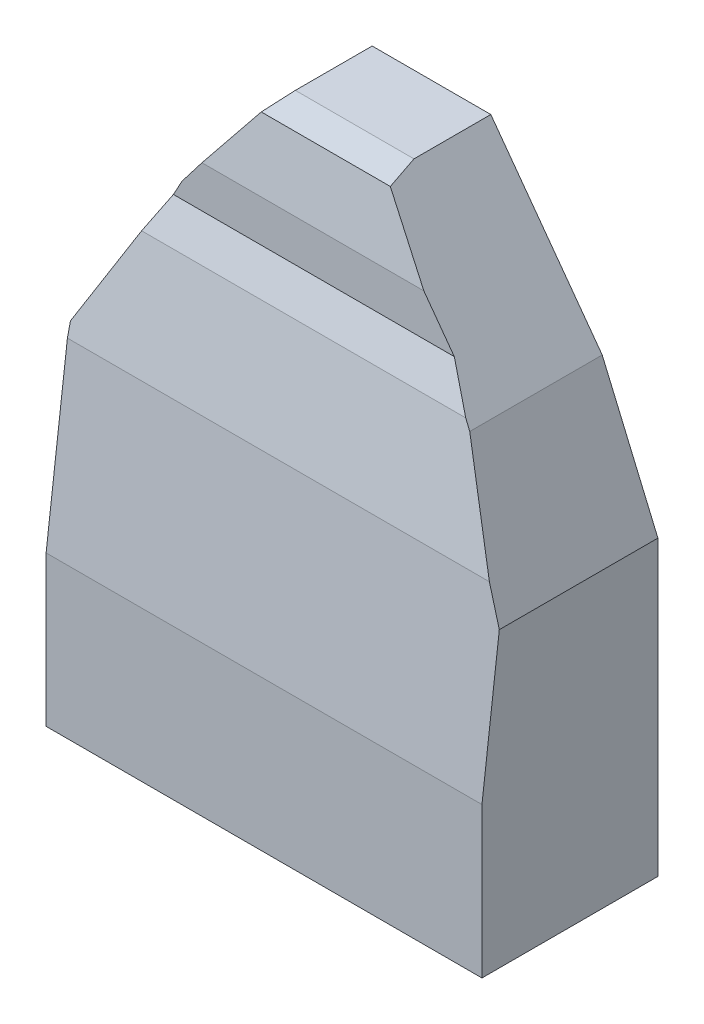
ISO-10303-21;
HEADER;
FILE_DESCRIPTION(('STEP AP214'),'2;1');
FILE_NAME('part.step','',(''),(''),'','','');
FILE_SCHEMA(('AUTOMOTIVE_DESIGN { 1 0 10303 214 1 1 1 1 }'));
ENDSEC;
DATA;
#1=APPLICATION_CONTEXT('core data for automotive mechanical design processes');
#2=APPLICATION_PROTOCOL_DEFINITION('international standard','automotive_design',2000,#1);
#3=PRODUCT_CONTEXT('',#1,'mechanical');
#4=PRODUCT('Part','Part','',(#3));
#5=PRODUCT_RELATED_PRODUCT_CATEGORY('part','',(#4));
#6=PRODUCT_DEFINITION_FORMATION('','',#4);
#7=PRODUCT_DEFINITION_CONTEXT('part definition',#1,'design');
#8=PRODUCT_DEFINITION('design','',#6,#7);
#9=PRODUCT_DEFINITION_SHAPE('','',#8);
#10=(LENGTH_UNIT() NAMED_UNIT(*) SI_UNIT(.MILLI.,.METRE.));
#11=(NAMED_UNIT(*) PLANE_ANGLE_UNIT() SI_UNIT($,.RADIAN.));
#12=(NAMED_UNIT(*) SI_UNIT($,.STERADIAN.) SOLID_ANGLE_UNIT());
#13=UNCERTAINTY_MEASURE_WITH_UNIT(LENGTH_MEASURE(1.E-05),#10,'distance_accuracy_value','');
#14=(GEOMETRIC_REPRESENTATION_CONTEXT(3) GLOBAL_UNCERTAINTY_ASSIGNED_CONTEXT((#13)) GLOBAL_UNIT_ASSIGNED_CONTEXT((#10,
#11,#12)) REPRESENTATION_CONTEXT('',''));
#15=CARTESIAN_POINT('',(0.,0.,0.));
#16=DIRECTION('',(0.,0.,1.));
#17=DIRECTION('',(1.,0.,0.));
#18=AXIS2_PLACEMENT_3D('',#15,#16,#17);
#19=CARTESIAN_POINT('',(576.302521008403,0.,101.6));
#20=DIRECTION('',(-1.,0.,0.));
#21=DIRECTION('',(0.,0.,1.));
#22=AXIS2_PLACEMENT_3D('',#19,#20,#21);
#23=PLANE('',#22);
#24=DIRECTION('',(0.,0.,-1.));
#25=VECTOR('',#24,1.);
#26=CARTESIAN_POINT('',(576.302521008403,387.403361344538,101.6));
#27=LINE('',#26,#25);
#28=CARTESIAN_POINT('',(576.302521008403,387.403361344538,209.68872265246));
#29=VERTEX_POINT('',#28);
#30=CARTESIAN_POINT('',(576.302521008403,387.403361344538,0.));
#31=VERTEX_POINT('',#30);
#32=EDGE_CURVE('E237',#29,#31,#27,.T.);
#33=ORIENTED_EDGE('',*,*,#32,.F.);
#34=DIRECTION('',(0.,-0.99270006358816,0.120609219183544));
#35=VECTOR('',#34,1.);
#36=CARTESIAN_POINT('',(576.302521008403,198.648214009807,232.621743180966));
#37=LINE('',#36,#35);
#38=CARTESIAN_POINT('',(576.302521008403,198.648214009807,232.621743180966));
#39=VERTEX_POINT('',#38);
#40=EDGE_CURVE('E200',#29,#39,#37,.T.);
#41=ORIENTED_EDGE('',*,*,#40,.T.);
#42=DIRECTION('',(0.,-1.,0.));
#43=VECTOR('',#42,1.);
#44=CARTESIAN_POINT('',(576.302521008403,0.,232.621743180966));
#45=LINE('',#44,#43);
#46=CARTESIAN_POINT('',(576.302521008403,0.,232.621743180966));
#47=VERTEX_POINT('',#46);
#48=EDGE_CURVE('E260',#39,#47,#45,.T.);
#49=ORIENTED_EDGE('',*,*,#48,.T.);
#50=DIRECTION('',(0.,0.,-1.));
#51=VECTOR('',#50,1.);
#52=CARTESIAN_POINT('',(576.302521008403,0.,101.6));
#53=LINE('',#52,#51);
#54=CARTESIAN_POINT('',(576.302521008403,0.,0.));
#55=VERTEX_POINT('',#54);
#56=EDGE_CURVE('E194',#47,#55,#53,.T.);
#57=ORIENTED_EDGE('',*,*,#56,.T.);
#58=DIRECTION('',(0.,1.,0.));
#59=VECTOR('',#58,1.);
#60=CARTESIAN_POINT('',(576.302521008403,0.,0.));
#61=LINE('',#60,#59);
#62=EDGE_CURVE('E195',#55,#31,#61,.T.);
#63=ORIENTED_EDGE('',*,*,#62,.T.);
#64=EDGE_LOOP('',(#33,#41,#49,#57,#63));
#65=FACE_BOUND('',#64,.T.);
#66=ADVANCED_FACE('F39',(#65),#23,.F.);
#67=CARTESIAN_POINT('',(576.302521008403,387.403361344538,101.6));
#68=DIRECTION('',(-0.920023978989581,-0.39186206512519,0.));
#69=DIRECTION('',(0.39186206512519,-0.920023978989581,0.));
#70=AXIS2_PLACEMENT_3D('',#67,#68,#69);
#71=PLANE('',#70);
#72=DIRECTION('',(-0.39186206512519,0.920023978989581,0.));
#73=VECTOR('',#72,1.);
#74=CARTESIAN_POINT('',(576.302521008403,387.403361344538,0.));
#75=LINE('',#74,#73);
#76=CARTESIAN_POINT('',(502.663865546219,560.294117647059,0.));
#77=VERTEX_POINT('',#76);
#78=EDGE_CURVE('E199',#31,#77,#75,.T.);
#79=ORIENTED_EDGE('',*,*,#78,.T.);
#80=DIRECTION('',(0.,0.,-1.));
#81=VECTOR('',#80,1.);
#82=CARTESIAN_POINT('',(502.663865546219,560.294117647059,101.6));
#83=LINE('',#82,#81);
#84=CARTESIAN_POINT('',(502.663865546219,560.294117647059,175.154658465266));
#85=VERTEX_POINT('',#84);
#86=EDGE_CURVE('E173',#85,#77,#83,.T.);
#87=ORIENTED_EDGE('',*,*,#86,.F.);
#88=DIRECTION('',(0.383675355992072,-0.900803009720522,0.203340008072209));
#89=VECTOR('',#88,1.);
#90=CARTESIAN_POINT('',(674.46393019594,156.937444121624,266.205141607066));
#91=LINE('',#90,#89);
#92=CARTESIAN_POINT('',(557.943732653935,430.506603568072,204.451845392607));
#93=VERTEX_POINT('',#92);
#94=EDGE_CURVE('E54',#85,#93,#91,.T.);
#95=ORIENTED_EDGE('',*,*,#94,.T.);
#96=DIRECTION('',(0.389436685103824,-0.914329608504635,0.111087511931388));
#97=VECTOR('',#96,1.);
#98=CARTESIAN_POINT('',(761.766874631309,-48.0346862918508,262.59276170168));
#99=LINE('',#98,#97);
#100=EDGE_CURVE('E47',#93,#29,#99,.T.);
#101=ORIENTED_EDGE('',*,*,#100,.T.);
#102=ORIENTED_EDGE('',*,*,#32,.T.);
#103=EDGE_LOOP('',(#79,#87,#95,#101,#102));
#104=FACE_BOUND('',#103,.T.);
#105=ADVANCED_FACE('F249',(#104),#71,.F.);
#106=CARTESIAN_POINT('',(502.663865546219,560.294117647059,101.6));
#107=DIRECTION('',(-0.807625937479147,-0.589695128953028,0.));
#108=DIRECTION('',(0.589695128953029,-0.807625937479147,0.));
#109=AXIS2_PLACEMENT_3D('',#106,#107,#108);
#110=PLANE('',#109);
#111=DIRECTION('',(-0.589695128953029,0.807625937479147,0.));
#112=VECTOR('',#111,1.);
#113=CARTESIAN_POINT('',(502.663865546219,560.294117647059,0.));
#114=LINE('',#113,#112);
#115=CARTESIAN_POINT('',(355.386554621849,762.,0.));
#116=VERTEX_POINT('',#115);
#117=EDGE_CURVE('E169',#77,#116,#114,.T.);
#118=ORIENTED_EDGE('',*,*,#117,.T.);
#119=DIRECTION('',(0.,0.,-1.));
#120=VECTOR('',#119,1.);
#121=CARTESIAN_POINT('',(355.386554621849,762.,101.6));
#122=LINE('',#121,#120);
#123=CARTESIAN_POINT('',(355.386554621849,762.,101.6));
#124=VERTEX_POINT('',#123);
#125=EDGE_CURVE('E165',#124,#116,#122,.T.);
#126=ORIENTED_EDGE('',*,*,#125,.F.);
#127=DIRECTION('',(0.169511170256458,-0.23215660274254,0.957793962687868));
#128=VECTOR('',#127,1.);
#129=CARTESIAN_POINT('',(390.484400505825,713.931211071947,299.914393323824));
#130=LINE('',#129,#128);
#131=CARTESIAN_POINT('',(362.113232086487,752.787376515822,139.607943988774));
#132=VERTEX_POINT('',#131);
#133=EDGE_CURVE('E151',#124,#132,#130,.T.);
#134=ORIENTED_EDGE('',*,*,#133,.T.);
#135=DIRECTION('',(0.582937835084133,-0.798371382832616,0.150952361695207));
#136=VECTOR('',#135,1.);
#137=CARTESIAN_POINT('',(737.107267816838,239.208588450341,236.713041493628));
#138=LINE('',#137,#136);
#139=CARTESIAN_POINT('',(421.897970408379,670.908278379318,155.089264465625));
#140=VERTEX_POINT('',#139);
#141=EDGE_CURVE('E162',#132,#140,#138,.T.);
#142=ORIENTED_EDGE('',*,*,#141,.T.);
#143=DIRECTION('',(0.589695128953028,-0.807625937479147,0.));
#144=VECTOR('',#143,1.);
#145=CARTESIAN_POINT('',(770.748157817613,193.135195623194,155.089264465625));
#146=LINE('',#145,#144);
#147=CARTESIAN_POINT('',(462.205314743502,615.704741572519,155.089264465625));
#148=VERTEX_POINT('',#147);
#149=EDGE_CURVE('E395',#140,#148,#146,.T.);
#150=ORIENTED_EDGE('',*,*,#149,.T.);
#151=DIRECTION('',(0.561922004369035,-0.769588832070635,0.303276590850731));
#152=VECTOR('',#151,1.);
#153=CARTESIAN_POINT('',(764.798154631275,201.284113030569,318.402543147512));
#154=LINE('',#153,#152);
#155=CARTESIAN_POINT('',(494.984202869431,570.811916530486,172.780455352289));
#156=VERTEX_POINT('',#155);
#157=EDGE_CURVE('E398',#148,#156,#154,.T.);
#158=ORIENTED_EDGE('',*,*,#157,.T.);
#159=DIRECTION('',(0.580133321909504,-0.794530419136929,0.179350890369519));
#160=VECTOR('',#159,1.);
#161=CARTESIAN_POINT('',(850.537095698349,83.8590415691422,282.701270954521));
#162=LINE('',#161,#160);
#163=EDGE_CURVE('E11',#156,#85,#162,.T.);
#164=ORIENTED_EDGE('',*,*,#163,.T.);
#165=ORIENTED_EDGE('',*,*,#86,.T.);
#166=EDGE_LOOP('',(#118,#126,#134,#142,#150,#158,#164,#165));
#167=FACE_BOUND('',#166,.T.);
#168=ADVANCED_FACE('F166',(#167),#110,.F.);
#169=CARTESIAN_POINT('',(355.386554621849,762.,101.6));
#170=DIRECTION('',(0.,-1.,0.));
#171=DIRECTION('',(0.,0.,-1.));
#172=AXIS2_PLACEMENT_3D('',#169,#170,#171);
#173=PLANE('',#172);
#174=DIRECTION('',(-1.,0.,0.));
#175=VECTOR('',#174,1.);
#176=CARTESIAN_POINT('',(355.386554621849,762.,0.));
#177=LINE('',#176,#175);
#178=CARTESIAN_POINT('',(198.504201680673,762.,0.));
#179=VERTEX_POINT('',#178);
#180=EDGE_CURVE('E205',#116,#179,#177,.T.);
#181=ORIENTED_EDGE('',*,*,#180,.T.);
#182=DIRECTION('',(0.,0.,-1.));
#183=VECTOR('',#182,1.);
#184=CARTESIAN_POINT('',(198.504201680673,762.,101.6));
#185=LINE('',#184,#183);
#186=CARTESIAN_POINT('',(198.504201680672,762.,101.6));
#187=VERTEX_POINT('',#186);
#188=EDGE_CURVE('E174',#187,#179,#185,.T.);
#189=ORIENTED_EDGE('',*,*,#188,.F.);
#190=DIRECTION('',(-1.,0.,0.));
#191=VECTOR('',#190,1.);
#192=CARTESIAN_POINT('',(355.386554621849,762.,101.6));
#193=LINE('',#192,#191);
#194=CARTESIAN_POINT('',(198.514140193442,762.,101.6));
#195=VERTEX_POINT('',#194);
#196=EDGE_CURVE('E179',#195,#187,#193,.T.);
#197=ORIENTED_EDGE('',*,*,#196,.F.);
#198=EDGE_CURVE('E156',#124,#195,#193,.T.);
#199=ORIENTED_EDGE('',*,*,#198,.F.);
#200=ORIENTED_EDGE('',*,*,#125,.T.);
#201=EDGE_LOOP('',(#181,#189,#197,#199,#200));
#202=FACE_BOUND('',#201,.T.);
#203=ADVANCED_FACE('F177',(#202),#173,.F.);
#204=CARTESIAN_POINT('',(198.504201680673,762.,101.6));
#205=DIRECTION('',(0.7926239891046,-0.609710760849693,0.));
#206=DIRECTION('',(0.609710760849693,0.7926239891046,0.));
#207=AXIS2_PLACEMENT_3D('',#204,#205,#206);
#208=PLANE('',#207);
#209=DIRECTION('',(-0.609710760849693,-0.7926239891046,0.));
#210=VECTOR('',#209,1.);
#211=CARTESIAN_POINT('',(198.504201680673,762.,0.));
#212=LINE('',#211,#210);
#213=CARTESIAN_POINT('',(102.453781512605,637.134453781513,0.));
#214=VERTEX_POINT('',#213);
#215=EDGE_CURVE('E208',#179,#214,#212,.T.);
#216=ORIENTED_EDGE('',*,*,#215,.T.);
#217=DIRECTION('',(0.,0.,-1.));
#218=VECTOR('',#217,1.);
#219=CARTESIAN_POINT('',(102.453781512605,637.134453781513,101.6));
#220=LINE('',#219,#218);
#221=CARTESIAN_POINT('',(102.453781512605,637.134453781513,101.6));
#222=VERTEX_POINT('',#221);
#223=EDGE_CURVE('E228',#222,#214,#220,.T.);
#224=ORIENTED_EDGE('',*,*,#223,.F.);
#225=DIRECTION('',(-0.609710760849693,-0.7926239891046,0.));
#226=VECTOR('',#225,1.);
#227=CARTESIAN_POINT('',(198.504201680673,762.,101.6));
#228=LINE('',#227,#226);
#229=EDGE_CURVE('E181',#187,#222,#228,.T.);
#230=ORIENTED_EDGE('',*,*,#229,.F.);
#231=ORIENTED_EDGE('',*,*,#188,.T.);
#232=EDGE_LOOP('',(#216,#224,#230,#231));
#233=FACE_BOUND('',#232,.T.);
#234=ADVANCED_FACE('F321',(#233),#208,.F.);
#235=CARTESIAN_POINT('',(102.453781512605,637.134453781513,101.6));
#236=DIRECTION('',(0.879031855696728,-0.476763040377887,0.));
#237=DIRECTION('',(0.476763040377887,0.879031855696728,0.));
#238=AXIS2_PLACEMENT_3D('',#235,#236,#237);
#239=PLANE('',#238);
#240=DIRECTION('',(-0.476763040377887,-0.879031855696728,0.));
#241=VECTOR('',#240,1.);
#242=CARTESIAN_POINT('',(102.453781512605,637.134453781513,0.));
#243=LINE('',#242,#241);
#244=CARTESIAN_POINT('',(0.,448.235294117647,0.));
#245=VERTEX_POINT('',#244);
#246=EDGE_CURVE('E211',#214,#245,#243,.T.);
#247=ORIENTED_EDGE('',*,*,#246,.T.);
#248=DIRECTION('',(0.,0.,-1.));
#249=VECTOR('',#248,1.);
#250=CARTESIAN_POINT('',(0.,448.235294117647,101.6));
#251=LINE('',#250,#249);
#252=CARTESIAN_POINT('',(-1.38777878078145E-13,448.235294117647,200.449913737673));
#253=VERTEX_POINT('',#252);
#254=EDGE_CURVE('E62',#253,#245,#251,.T.);
#255=ORIENTED_EDGE('',*,*,#254,.F.);
#256=DIRECTION('',(0.467645680255062,0.862221722970269,-0.194630979489293));
#257=VECTOR('',#256,1.);
#258=CARTESIAN_POINT('',(287.609450899066,978.5152192128,80.7487991922936));
#259=LINE('',#258,#257);
#260=CARTESIAN_POINT('',(66.4822358849297,570.811916530486,172.780455352289));
#261=VERTEX_POINT('',#260);
#262=EDGE_CURVE('E241',#253,#261,#259,.T.);
#263=ORIENTED_EDGE('',*,*,#262,.T.);
#264=DIRECTION('',(0.450499381355594,0.830608234374376,-0.327322880941294));
#265=VECTOR('',#264,1.);
#266=CARTESIAN_POINT('',(326.867193589269,1050.89668229786,-16.4094925963554));
#267=LINE('',#266,#265);
#268=CARTESIAN_POINT('',(90.8308867551849,615.704741572519,155.089264465625));
#269=VERTEX_POINT('',#268);
#270=EDGE_CURVE('E381',#261,#269,#267,.T.);
#271=ORIENTED_EDGE('',*,*,#270,.T.);
#272=DIRECTION('',(0.476763040377887,0.879031855696728,0.));
#273=VECTOR('',#272,1.);
#274=CARTESIAN_POINT('',(376.926672521761,1143.19384657964,155.089264465625));
#275=LINE('',#274,#273);
#276=CARTESIAN_POINT('',(102.079559314268,636.444481603329,155.089264465625));
#277=VERTEX_POINT('',#276);
#278=EDGE_CURVE('E379',#269,#277,#275,.T.);
#279=ORIENTED_EDGE('',*,*,#278,.T.);
#280=DIRECTION('',(0.,0.,-1.));
#281=VECTOR('',#280,1.);
#282=CARTESIAN_POINT('',(102.079559314268,636.444481603329,232.621743180966));
#283=LINE('',#282,#281);
#284=CARTESIAN_POINT('',(102.079559314268,636.444481603329,101.6));
#285=VERTEX_POINT('',#284);
#286=EDGE_CURVE('E372',#277,#285,#283,.T.);
#287=ORIENTED_EDGE('',*,*,#286,.T.);
#288=DIRECTION('',(-0.476763040377887,-0.879031855696728,0.));
#289=VECTOR('',#288,1.);
#290=CARTESIAN_POINT('',(102.453781512605,637.134453781513,101.6));
#291=LINE('',#290,#289);
#292=EDGE_CURVE('E185',#222,#285,#291,.T.);
#293=ORIENTED_EDGE('',*,*,#292,.F.);
#294=ORIENTED_EDGE('',*,*,#223,.T.);
#295=EDGE_LOOP('',(#247,#255,#263,#271,#279,#287,#293,#294));
#296=FACE_BOUND('',#295,.T.);
#297=ADVANCED_FACE('F324',(#296),#239,.F.);
#298=CARTESIAN_POINT('',(0.,448.235294117647,101.6));
#299=DIRECTION('',(1.,0.,0.));
#300=DIRECTION('',(0.,0.,-1.));
#301=AXIS2_PLACEMENT_3D('',#298,#299,#300);
#302=PLANE('',#301);
#303=DIRECTION('',(0.,0.975456616301023,-0.220191711275785));
#304=VECTOR('',#303,1.);
#305=CARTESIAN_POINT('',(0.,430.506603568072,204.451845392607));
#306=LINE('',#305,#304);
#307=CARTESIAN_POINT('',(0.,430.506603568072,204.451845392607));
#308=VERTEX_POINT('',#307);
#309=EDGE_CURVE('E275',#308,#253,#306,.T.);
#310=ORIENTED_EDGE('',*,*,#309,.T.);
#311=ORIENTED_EDGE('',*,*,#254,.T.);
#312=DIRECTION('',(0.,-1.,0.));
#313=VECTOR('',#312,1.);
#314=CARTESIAN_POINT('',(0.,448.235294117647,0.));
#315=LINE('',#314,#313);
#316=CARTESIAN_POINT('',(0.,0.,0.));
#317=VERTEX_POINT('',#316);
#318=EDGE_CURVE('E214',#245,#317,#315,.T.);
#319=ORIENTED_EDGE('',*,*,#318,.T.);
#320=DIRECTION('',(0.,0.,-1.));
#321=VECTOR('',#320,1.);
#322=CARTESIAN_POINT('',(0.,0.,101.6));
#323=LINE('',#322,#321);
#324=CARTESIAN_POINT('',(0.,0.,232.621743180966));
#325=VERTEX_POINT('',#324);
#326=EDGE_CURVE('E222',#325,#317,#323,.T.);
#327=ORIENTED_EDGE('',*,*,#326,.F.);
#328=DIRECTION('',(0.,1.,0.));
#329=VECTOR('',#328,1.);
#330=CARTESIAN_POINT('',(0.,0.,232.621743180966));
#331=LINE('',#330,#329);
#332=CARTESIAN_POINT('',(0.,198.648214009807,232.621743180966));
#333=VERTEX_POINT('',#332);
#334=EDGE_CURVE('E266',#325,#333,#331,.T.);
#335=ORIENTED_EDGE('',*,*,#334,.T.);
#336=DIRECTION('',(0.,0.992700063588159,-0.120609219183544));
#337=VECTOR('',#336,1.);
#338=CARTESIAN_POINT('',(0.,198.648214009807,232.621743180966));
#339=LINE('',#338,#337);
#340=EDGE_CURVE('E270',#333,#308,#339,.T.);
#341=ORIENTED_EDGE('',*,*,#340,.T.);
#342=EDGE_LOOP('',(#310,#311,#319,#327,#335,#341));
#343=FACE_BOUND('',#342,.T.);
#344=ADVANCED_FACE('F303',(#343),#302,.F.);
#345=CARTESIAN_POINT('',(0.,0.,101.6));
#346=DIRECTION('',(0.,1.,0.));
#347=DIRECTION('',(0.,0.,1.));
#348=AXIS2_PLACEMENT_3D('',#345,#346,#347);
#349=PLANE('',#348);
#350=DIRECTION('',(1.,0.,0.));
#351=VECTOR('',#350,1.);
#352=CARTESIAN_POINT('',(0.,0.,0.));
#353=LINE('',#352,#351);
#354=EDGE_CURVE('E187',#317,#55,#353,.T.);
#355=ORIENTED_EDGE('',*,*,#354,.T.);
#356=ORIENTED_EDGE('',*,*,#56,.F.);
#357=DIRECTION('',(-1.,0.,0.));
#358=VECTOR('',#357,1.);
#359=CARTESIAN_POINT('',(1349.48470987865,0.,232.621743180966));
#360=LINE('',#359,#358);
#361=EDGE_CURVE('E189',#47,#325,#360,.T.);
#362=ORIENTED_EDGE('',*,*,#361,.T.);
#363=ORIENTED_EDGE('',*,*,#326,.T.);
#364=EDGE_LOOP('',(#355,#356,#362,#363));
#365=FACE_BOUND('',#364,.T.);
#366=ADVANCED_FACE('F299',(#365),#349,.F.);
#367=CARTESIAN_POINT('',(0.,0.,0.));
#368=DIRECTION('',(0.,0.,1.));
#369=DIRECTION('',(1.,0.,0.));
#370=AXIS2_PLACEMENT_3D('',#367,#368,#369);
#371=PLANE('',#370);
#372=ORIENTED_EDGE('',*,*,#62,.F.);
#373=ORIENTED_EDGE('',*,*,#354,.F.);
#374=ORIENTED_EDGE('',*,*,#318,.F.);
#375=ORIENTED_EDGE('',*,*,#246,.F.);
#376=ORIENTED_EDGE('',*,*,#215,.F.);
#377=ORIENTED_EDGE('',*,*,#180,.F.);
#378=ORIENTED_EDGE('',*,*,#117,.F.);
#379=ORIENTED_EDGE('',*,*,#78,.F.);
#380=EDGE_LOOP('',(#372,#373,#374,#375,#376,#377,#378,#379));
#381=FACE_BOUND('',#380,.T.);
#382=ADVANCED_FACE('F308',(#381),#371,.F.);
#383=CARTESIAN_POINT('',(1349.48470987865,752.787376515822,139.607943988774));
#384=DIRECTION('',(0.,0.971858439473431,0.235565646103729));
#385=DIRECTION('',(0.,-0.235565646103729,0.971858439473431));
#386=AXIS2_PLACEMENT_3D('',#383,#384,#385);
#387=PLANE('',#386);
#388=ORIENTED_EDGE('',*,*,#133,.F.);
#389=ORIENTED_EDGE('',*,*,#198,.T.);
#390=DIRECTION('',(0.178038698581419,0.231802128357528,-0.956331529908094));
#391=VECTOR('',#390,1.);
#392=CARTESIAN_POINT('',(228.145761982899,800.579663029498,-57.5657006333951));
#393=LINE('',#392,#391);
#394=CARTESIAN_POINT('',(191.438262559075,752.787376515822,139.607943988774));
#395=VERTEX_POINT('',#394);
#396=EDGE_CURVE('E271',#395,#195,#393,.T.);
#397=ORIENTED_EDGE('',*,*,#396,.F.);
#398=DIRECTION('',(-1.,0.,0.));
#399=VECTOR('',#398,1.);
#400=CARTESIAN_POINT('',(1349.48470987865,752.787376515822,139.607943988774));
#401=LINE('',#400,#399);
#402=EDGE_CURVE('E157',#132,#395,#401,.T.);
#403=ORIENTED_EDGE('',*,*,#402,.F.);
#404=EDGE_LOOP('',(#388,#389,#397,#403));
#405=FACE_BOUND('',#404,.T.);
#406=ADVANCED_FACE('F153',(#405),#387,.T.);
#407=CARTESIAN_POINT('',(1349.48470987865,670.908278379318,155.089264465625));
#408=DIRECTION('',(0.,0.185783690480533,0.982590667751039));
#409=DIRECTION('',(0.,-0.982590667751039,0.185783690480533));
#410=AXIS2_PLACEMENT_3D('',#407,#408,#409);
#411=PLANE('',#410);
#412=ORIENTED_EDGE('',*,*,#141,.F.);
#413=ORIENTED_EDGE('',*,*,#402,.T.);
#414=DIRECTION('',(0.602394096410472,0.784302709301712,-0.148292322093244));
#415=VECTOR('',#414,1.);
#416=CARTESIAN_POINT('',(571.601094944895,1247.75029396919,46.0226490398937));
#417=LINE('',#416,#415);
#418=CARTESIAN_POINT('',(128.549935447776,670.908278379318,155.089264465625));
#419=VERTEX_POINT('',#418);
#420=EDGE_CURVE('E388',#419,#395,#417,.T.);
#421=ORIENTED_EDGE('',*,*,#420,.F.);
#422=DIRECTION('',(-1.,0.,0.));
#423=VECTOR('',#422,1.);
#424=CARTESIAN_POINT('',(1349.48470987865,670.908278379318,155.089264465625));
#425=LINE('',#424,#423);
#426=EDGE_CURVE('E281',#140,#419,#425,.T.);
#427=ORIENTED_EDGE('',*,*,#426,.F.);
#428=EDGE_LOOP('',(#412,#413,#421,#427));
#429=FACE_BOUND('',#428,.T.);
#430=ADVANCED_FACE('F350',(#429),#411,.T.);
#431=CARTESIAN_POINT('',(1349.48470987865,615.704741572519,155.089264465625));
#432=DIRECTION('',(0.,0.,1.));
#433=DIRECTION('',(1.,0.,0.));
#434=AXIS2_PLACEMENT_3D('',#431,#432,#433);
#435=PLANE('',#434);
#436=ORIENTED_EDGE('',*,*,#149,.F.);
#437=ORIENTED_EDGE('',*,*,#426,.T.);
#438=DIRECTION('',(0.609128886515623,0.793071244978809,0.));
#439=VECTOR('',#438,1.);
#440=CARTESIAN_POINT('',(554.895264424791,1225.99970209565,155.089264465625));
#441=LINE('',#440,#439);
#442=EDGE_CURVE('E244',#277,#419,#441,.T.);
#443=ORIENTED_EDGE('',*,*,#442,.F.);
#444=ORIENTED_EDGE('',*,*,#278,.F.);
#445=DIRECTION('',(-1.,0.,0.));
#446=VECTOR('',#445,1.);
#447=CARTESIAN_POINT('',(1349.48470987865,615.704741572519,155.089264465625));
#448=LINE('',#447,#446);
#449=EDGE_CURVE('E284',#148,#269,#448,.T.);
#450=ORIENTED_EDGE('',*,*,#449,.F.);
#451=EDGE_LOOP('',(#436,#437,#443,#444,#450));
#452=FACE_BOUND('',#451,.T.);
#453=ADVANCED_FACE('F346',(#452),#435,.T.);
#454=CARTESIAN_POINT('',(1349.48470987865,570.811916530486,172.780455352289));
#455=DIRECTION('',(0.,0.366634642563736,0.930365003034917));
#456=DIRECTION('',(0.,-0.930365003034917,0.366634642563736));
#457=AXIS2_PLACEMENT_3D('',#454,#455,#456);
#458=PLANE('',#457);
#459=ORIENTED_EDGE('',*,*,#157,.F.);
#460=ORIENTED_EDGE('',*,*,#449,.T.);
#461=ORIENTED_EDGE('',*,*,#270,.F.);
#462=DIRECTION('',(-1.,0.,0.));
#463=VECTOR('',#462,1.);
#464=CARTESIAN_POINT('',(1349.48470987865,570.811916530486,172.780455352289));
#465=LINE('',#464,#463);
#466=EDGE_CURVE('E287',#156,#261,#465,.T.);
#467=ORIENTED_EDGE('',*,*,#466,.F.);
#468=EDGE_LOOP('',(#459,#460,#461,#467));
#469=FACE_BOUND('',#468,.T.);
#470=ADVANCED_FACE('F342',(#469),#458,.T.);
#471=CARTESIAN_POINT('',(1349.48470987865,430.506603568072,204.451845392607));
#472=DIRECTION('',(0.,0.220191711275785,0.975456616301023));
#473=DIRECTION('',(0.,-0.975456616301023,0.220191711275785));
#474=AXIS2_PLACEMENT_3D('',#471,#472,#473);
#475=PLANE('',#474);
#476=ORIENTED_EDGE('',*,*,#163,.F.);
#477=ORIENTED_EDGE('',*,*,#466,.T.);
#478=ORIENTED_EDGE('',*,*,#262,.F.);
#479=ORIENTED_EDGE('',*,*,#309,.F.);
#480=DIRECTION('',(-1.,0.,0.));
#481=VECTOR('',#480,1.);
#482=CARTESIAN_POINT('',(1349.48470987865,430.506603568072,204.451845392607));
#483=LINE('',#482,#481);
#484=EDGE_CURVE('E290',#93,#308,#483,.T.);
#485=ORIENTED_EDGE('',*,*,#484,.F.);
#486=ORIENTED_EDGE('',*,*,#94,.F.);
#487=EDGE_LOOP('',(#476,#477,#478,#479,#485,#486));
#488=FACE_BOUND('',#487,.T.);
#489=ADVANCED_FACE('F339',(#488),#475,.T.);
#490=CARTESIAN_POINT('',(1349.48470987865,198.648214009807,232.621743180966));
#491=DIRECTION('',(0.,0.120609219183544,0.99270006358816));
#492=DIRECTION('',(0.,-0.99270006358816,0.120609219183544));
#493=AXIS2_PLACEMENT_3D('',#490,#491,#492);
#494=PLANE('',#493);
#495=ORIENTED_EDGE('',*,*,#100,.F.);
#496=ORIENTED_EDGE('',*,*,#484,.T.);
#497=ORIENTED_EDGE('',*,*,#340,.F.);
#498=DIRECTION('',(-1.,0.,0.));
#499=VECTOR('',#498,1.);
#500=CARTESIAN_POINT('',(1349.48470987865,198.648214009807,232.621743180966));
#501=LINE('',#500,#499);
#502=EDGE_CURVE('E255',#39,#333,#501,.T.);
#503=ORIENTED_EDGE('',*,*,#502,.F.);
#504=ORIENTED_EDGE('',*,*,#40,.F.);
#505=EDGE_LOOP('',(#495,#496,#497,#503,#504));
#506=FACE_BOUND('',#505,.T.);
#507=ADVANCED_FACE('F253',(#506),#494,.T.);
#508=CARTESIAN_POINT('',(1349.48470987865,0.,232.621743180966));
#509=DIRECTION('',(0.,0.,1.));
#510=DIRECTION('',(1.,0.,0.));
#511=AXIS2_PLACEMENT_3D('',#508,#509,#510);
#512=PLANE('',#511);
#513=ORIENTED_EDGE('',*,*,#48,.F.);
#514=ORIENTED_EDGE('',*,*,#502,.T.);
#515=ORIENTED_EDGE('',*,*,#334,.F.);
#516=ORIENTED_EDGE('',*,*,#361,.F.);
#517=EDGE_LOOP('',(#513,#514,#515,#516));
#518=FACE_BOUND('',#517,.T.);
#519=ADVANCED_FACE('F301',(#518),#512,.T.);
#520=CARTESIAN_POINT('',(0.,0.,101.6));
#521=DIRECTION('',(0.,0.,1.));
#522=DIRECTION('',(0.,-1.,0.));
#523=AXIS2_PLACEMENT_3D('',#520,#521,#522);
#524=PLANE('',#523);
#525=ORIENTED_EDGE('',*,*,#292,.T.);
#526=DIRECTION('',(-0.609128886515623,-0.793071244978809,0.));
#527=VECTOR('',#526,1.);
#528=CARTESIAN_POINT('',(102.079559314268,636.444481603329,101.6));
#529=LINE('',#528,#527);
#530=EDGE_CURVE('E161',#195,#285,#529,.T.);
#531=ORIENTED_EDGE('',*,*,#530,.F.);
#532=ORIENTED_EDGE('',*,*,#196,.T.);
#533=ORIENTED_EDGE('',*,*,#229,.T.);
#534=EDGE_LOOP('',(#525,#531,#532,#533));
#535=FACE_BOUND('',#534,.T.);
#536=ADVANCED_FACE('F336',(#535),#524,.T.);
#537=CARTESIAN_POINT('',(102.079559314268,636.444481603329,232.621743180966));
#538=DIRECTION('',(0.793071244978809,-0.609128886515623,0.));
#539=DIRECTION('',(0.609128886515623,0.793071244978809,0.));
#540=AXIS2_PLACEMENT_3D('',#537,#538,#539);
#541=PLANE('',#540);
#542=ORIENTED_EDGE('',*,*,#396,.T.);
#543=ORIENTED_EDGE('',*,*,#530,.T.);
#544=ORIENTED_EDGE('',*,*,#286,.F.);
#545=ORIENTED_EDGE('',*,*,#442,.T.);
#546=ORIENTED_EDGE('',*,*,#420,.T.);
#547=EDGE_LOOP('',(#542,#543,#544,#545,#546));
#548=FACE_BOUND('',#547,.T.);
#549=ADVANCED_FACE('F357',(#548),#541,.F.);
#550=CLOSED_SHELL('',(#66,#105,#168,#203,#234,#297,#344,#366,#382,#406,#430,#453,#470,#489,#507,
#519,#536,#549));
#551=MANIFOLD_SOLID_BREP('B2',#550);
#552=ADVANCED_BREP_SHAPE_REPRESENTATION('',(#18,#551),#14);
#553=SHAPE_DEFINITION_REPRESENTATION(#9,#552);
ENDSEC;
END-ISO-10303-21;
